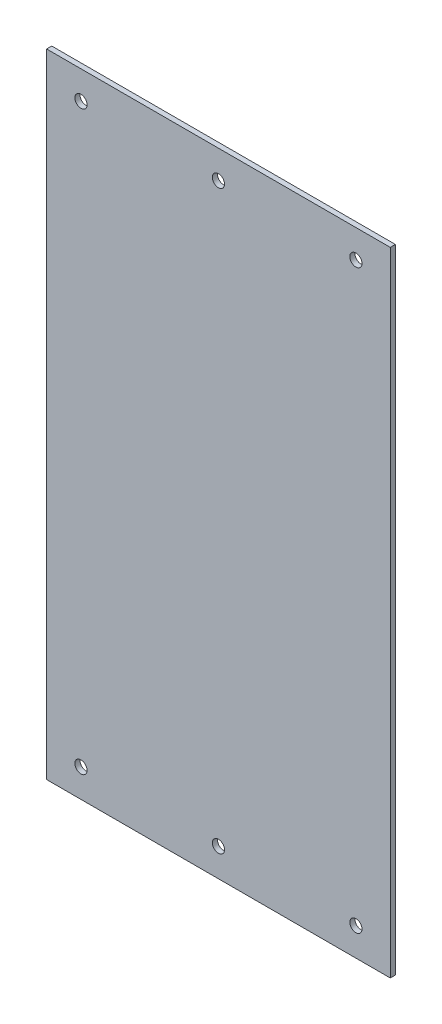
ISO-10303-21;
HEADER;
FILE_DESCRIPTION(('STEP AP214'),'2;1');
FILE_NAME('part.step','',(''),(''),'','','');
FILE_SCHEMA(('AUTOMOTIVE_DESIGN { 1 0 10303 214 1 1 1 1 }'));
ENDSEC;
DATA;
#1=APPLICATION_CONTEXT('core data for automotive mechanical design processes');
#2=APPLICATION_PROTOCOL_DEFINITION('international standard','automotive_design',2000,#1);
#3=PRODUCT_CONTEXT('',#1,'mechanical');
#4=PRODUCT('Part','Part','',(#3));
#5=PRODUCT_RELATED_PRODUCT_CATEGORY('part','',(#4));
#6=PRODUCT_DEFINITION_FORMATION('','',#4);
#7=PRODUCT_DEFINITION_CONTEXT('part definition',#1,'design');
#8=PRODUCT_DEFINITION('design','',#6,#7);
#9=PRODUCT_DEFINITION_SHAPE('','',#8);
#10=(LENGTH_UNIT() NAMED_UNIT(*) SI_UNIT(.MILLI.,.METRE.));
#11=(NAMED_UNIT(*) PLANE_ANGLE_UNIT() SI_UNIT($,.RADIAN.));
#12=(NAMED_UNIT(*) SI_UNIT($,.STERADIAN.) SOLID_ANGLE_UNIT());
#13=UNCERTAINTY_MEASURE_WITH_UNIT(LENGTH_MEASURE(1.E-05),#10,'distance_accuracy_value','');
#14=(GEOMETRIC_REPRESENTATION_CONTEXT(3) GLOBAL_UNCERTAINTY_ASSIGNED_CONTEXT((#13)) GLOBAL_UNIT_ASSIGNED_CONTEXT((#10,
#11,#12)) REPRESENTATION_CONTEXT('',''));
#15=CARTESIAN_POINT('',(0.,0.,0.));
#16=DIRECTION('',(0.,0.,1.));
#17=DIRECTION('',(1.,0.,0.));
#18=AXIS2_PLACEMENT_3D('',#15,#16,#17);
#19=CARTESIAN_POINT('',(77.5,142.695,2.305));
#20=DIRECTION('',(-1.,0.,0.));
#21=DIRECTION('',(0.,-1.,0.));
#22=AXIS2_PLACEMENT_3D('',#19,#20,#21);
#23=PLANE('',#22);
#24=DIRECTION('',(0.,1.,0.));
#25=VECTOR('',#24,1.);
#26=CARTESIAN_POINT('',(77.5,142.695,0.));
#27=LINE('',#26,#25);
#28=CARTESIAN_POINT('',(77.5,-142.695,0.));
#29=VERTEX_POINT('',#28);
#30=CARTESIAN_POINT('',(77.5,142.695,0.));
#31=VERTEX_POINT('',#30);
#32=EDGE_CURVE('E109',#29,#31,#27,.T.);
#33=ORIENTED_EDGE('',*,*,#32,.T.);
#34=DIRECTION('',(0.,0.,-1.));
#35=VECTOR('',#34,1.);
#36=CARTESIAN_POINT('',(77.5,142.695,2.305));
#37=LINE('',#36,#35);
#38=CARTESIAN_POINT('',(77.5,142.695,2.305));
#39=VERTEX_POINT('',#38);
#40=EDGE_CURVE('E11',#39,#31,#37,.T.);
#41=ORIENTED_EDGE('',*,*,#40,.F.);
#42=DIRECTION('',(0.,1.,0.));
#43=VECTOR('',#42,1.);
#44=CARTESIAN_POINT('',(77.5,142.695,2.305));
#45=LINE('',#44,#43);
#46=CARTESIAN_POINT('',(77.5,-142.695,2.305));
#47=VERTEX_POINT('',#46);
#48=EDGE_CURVE('E92',#47,#39,#45,.T.);
#49=ORIENTED_EDGE('',*,*,#48,.F.);
#50=DIRECTION('',(0.,0.,-1.));
#51=VECTOR('',#50,1.);
#52=CARTESIAN_POINT('',(77.5,-142.695,2.305));
#53=LINE('',#52,#51);
#54=EDGE_CURVE('E105',#47,#29,#53,.T.);
#55=ORIENTED_EDGE('',*,*,#54,.T.);
#56=EDGE_LOOP('',(#33,#41,#49,#55));
#57=FACE_BOUND('',#56,.T.);
#58=ADVANCED_FACE('F40',(#57),#23,.F.);
#59=CARTESIAN_POINT('',(-77.5,142.695,2.305));
#60=DIRECTION('',(0.,-1.,0.));
#61=DIRECTION('',(0.,0.,-1.));
#62=AXIS2_PLACEMENT_3D('',#59,#60,#61);
#63=PLANE('',#62);
#64=DIRECTION('',(-1.,0.,0.));
#65=VECTOR('',#64,1.);
#66=CARTESIAN_POINT('',(-77.5,142.695,0.));
#67=LINE('',#66,#65);
#68=CARTESIAN_POINT('',(-77.5,142.695,0.));
#69=VERTEX_POINT('',#68);
#70=EDGE_CURVE('E97',#31,#69,#67,.T.);
#71=ORIENTED_EDGE('',*,*,#70,.T.);
#72=DIRECTION('',(0.,0.,-1.));
#73=VECTOR('',#72,1.);
#74=CARTESIAN_POINT('',(-77.5,142.695,2.305));
#75=LINE('',#74,#73);
#76=CARTESIAN_POINT('',(-77.5,142.695,2.305));
#77=VERTEX_POINT('',#76);
#78=EDGE_CURVE('E49',#77,#69,#75,.T.);
#79=ORIENTED_EDGE('',*,*,#78,.F.);
#80=DIRECTION('',(-1.,0.,0.));
#81=VECTOR('',#80,1.);
#82=CARTESIAN_POINT('',(-77.5,142.695,2.305));
#83=LINE('',#82,#81);
#84=EDGE_CURVE('E87',#39,#77,#83,.T.);
#85=ORIENTED_EDGE('',*,*,#84,.F.);
#86=ORIENTED_EDGE('',*,*,#40,.T.);
#87=EDGE_LOOP('',(#71,#79,#85,#86));
#88=FACE_BOUND('',#87,.T.);
#89=ADVANCED_FACE('F96',(#88),#63,.F.);
#90=CARTESIAN_POINT('',(-77.5,142.695,2.305));
#91=DIRECTION('',(1.,0.,0.));
#92=DIRECTION('',(0.,1.,0.));
#93=AXIS2_PLACEMENT_3D('',#90,#91,#92);
#94=PLANE('',#93);
#95=DIRECTION('',(0.,-1.,0.));
#96=VECTOR('',#95,1.);
#97=CARTESIAN_POINT('',(-77.5,142.695,0.));
#98=LINE('',#97,#96);
#99=CARTESIAN_POINT('',(-77.5,-142.695,0.));
#100=VERTEX_POINT('',#99);
#101=EDGE_CURVE('E74',#69,#100,#98,.T.);
#102=ORIENTED_EDGE('',*,*,#101,.T.);
#103=DIRECTION('',(0.,0.,-1.));
#104=VECTOR('',#103,1.);
#105=CARTESIAN_POINT('',(-77.5,-142.695,2.305));
#106=LINE('',#105,#104);
#107=CARTESIAN_POINT('',(-77.5,-142.695,2.305));
#108=VERTEX_POINT('',#107);
#109=EDGE_CURVE('E99',#108,#100,#106,.T.);
#110=ORIENTED_EDGE('',*,*,#109,.F.);
#111=DIRECTION('',(0.,-1.,0.));
#112=VECTOR('',#111,1.);
#113=CARTESIAN_POINT('',(-77.5,142.695,2.305));
#114=LINE('',#113,#112);
#115=EDGE_CURVE('E90',#77,#108,#114,.T.);
#116=ORIENTED_EDGE('',*,*,#115,.F.);
#117=ORIENTED_EDGE('',*,*,#78,.T.);
#118=EDGE_LOOP('',(#102,#110,#116,#117));
#119=FACE_BOUND('',#118,.T.);
#120=ADVANCED_FACE('F100',(#119),#94,.F.);
#121=CARTESIAN_POINT('',(-77.5,-142.695,2.305));
#122=DIRECTION('',(0.,1.,0.));
#123=DIRECTION('',(0.,0.,1.));
#124=AXIS2_PLACEMENT_3D('',#121,#122,#123);
#125=PLANE('',#124);
#126=DIRECTION('',(1.,0.,0.));
#127=VECTOR('',#126,1.);
#128=CARTESIAN_POINT('',(-77.5,-142.695,0.));
#129=LINE('',#128,#127);
#130=EDGE_CURVE('E80',#100,#29,#129,.T.);
#131=ORIENTED_EDGE('',*,*,#130,.T.);
#132=ORIENTED_EDGE('',*,*,#54,.F.);
#133=DIRECTION('',(1.,0.,0.));
#134=VECTOR('',#133,1.);
#135=CARTESIAN_POINT('',(-77.5,-142.695,2.305));
#136=LINE('',#135,#134);
#137=EDGE_CURVE('E57',#108,#47,#136,.T.);
#138=ORIENTED_EDGE('',*,*,#137,.F.);
#139=ORIENTED_EDGE('',*,*,#109,.T.);
#140=EDGE_LOOP('',(#131,#132,#138,#139));
#141=FACE_BOUND('',#140,.T.);
#142=ADVANCED_FACE('F124',(#141),#125,.F.);
#143=CARTESIAN_POINT('',(0.,0.,2.305));
#144=DIRECTION('',(0.,0.,1.));
#145=DIRECTION('',(1.,0.,0.));
#146=AXIS2_PLACEMENT_3D('',#143,#144,#145);
#147=PLANE('',#146);
#148=CARTESIAN_POINT('',(-62.,129.995,2.305));
#149=DIRECTION('',(0.,0.,1.));
#150=DIRECTION('',(1.,0.,0.));
#151=AXIS2_PLACEMENT_3D('',#148,#149,#150);
#152=CIRCLE('',#151,2.74999999999999);
#153=CARTESIAN_POINT('',(-59.25,129.995,2.305));
#154=VERTEX_POINT('',#153);
#155=EDGE_CURVE('E175',#154,#154,#152,.T.);
#156=ORIENTED_EDGE('',*,*,#155,.F.);
#157=EDGE_LOOP('',(#156));
#158=FACE_BOUND('',#157,.T.);
#159=CARTESIAN_POINT('',(0.,129.995,2.305));
#160=DIRECTION('',(0.,0.,1.));
#161=DIRECTION('',(1.,0.,0.));
#162=AXIS2_PLACEMENT_3D('',#159,#160,#161);
#163=CIRCLE('',#162,2.74999999999999);
#164=CARTESIAN_POINT('',(2.74999999999999,129.995,2.305));
#165=VERTEX_POINT('',#164);
#166=EDGE_CURVE('E167',#165,#165,#163,.T.);
#167=ORIENTED_EDGE('',*,*,#166,.F.);
#168=EDGE_LOOP('',(#167));
#169=FACE_BOUND('',#168,.T.);
#170=CARTESIAN_POINT('',(62.,129.995,2.305));
#171=DIRECTION('',(0.,0.,1.));
#172=DIRECTION('',(1.,0.,0.));
#173=AXIS2_PLACEMENT_3D('',#170,#171,#172);
#174=CIRCLE('',#173,2.74999999999999);
#175=CARTESIAN_POINT('',(64.75,129.995,2.305));
#176=VERTEX_POINT('',#175);
#177=EDGE_CURVE('E159',#176,#176,#174,.T.);
#178=ORIENTED_EDGE('',*,*,#177,.F.);
#179=EDGE_LOOP('',(#178));
#180=FACE_BOUND('',#179,.T.);
#181=CARTESIAN_POINT('',(-62.,-129.995,2.305));
#182=DIRECTION('',(0.,0.,1.));
#183=DIRECTION('',(1.,0.,0.));
#184=AXIS2_PLACEMENT_3D('',#181,#182,#183);
#185=CIRCLE('',#184,2.74999999999999);
#186=CARTESIAN_POINT('',(-59.25,-129.995,2.305));
#187=VERTEX_POINT('',#186);
#188=EDGE_CURVE('E151',#187,#187,#185,.T.);
#189=ORIENTED_EDGE('',*,*,#188,.F.);
#190=EDGE_LOOP('',(#189));
#191=FACE_BOUND('',#190,.T.);
#192=CARTESIAN_POINT('',(0.,-129.995,2.305));
#193=DIRECTION('',(0.,0.,1.));
#194=DIRECTION('',(1.,0.,0.));
#195=AXIS2_PLACEMENT_3D('',#192,#193,#194);
#196=CIRCLE('',#195,2.74999999999999);
#197=CARTESIAN_POINT('',(2.74999999999999,-129.995,2.305));
#198=VERTEX_POINT('',#197);
#199=EDGE_CURVE('E143',#198,#198,#196,.T.);
#200=ORIENTED_EDGE('',*,*,#199,.F.);
#201=EDGE_LOOP('',(#200));
#202=FACE_BOUND('',#201,.T.);
#203=CARTESIAN_POINT('',(62.,-129.995,2.305));
#204=DIRECTION('',(0.,0.,1.));
#205=DIRECTION('',(1.,0.,0.));
#206=AXIS2_PLACEMENT_3D('',#203,#204,#205);
#207=CIRCLE('',#206,2.74999999999999);
#208=CARTESIAN_POINT('',(64.75,-129.995,2.305));
#209=VERTEX_POINT('',#208);
#210=EDGE_CURVE('E135',#209,#209,#207,.T.);
#211=ORIENTED_EDGE('',*,*,#210,.F.);
#212=EDGE_LOOP('',(#211));
#213=FACE_BOUND('',#212,.T.);
#214=ORIENTED_EDGE('',*,*,#48,.T.);
#215=ORIENTED_EDGE('',*,*,#84,.T.);
#216=ORIENTED_EDGE('',*,*,#115,.T.);
#217=ORIENTED_EDGE('',*,*,#137,.T.);
#218=EDGE_LOOP('',(#214,#215,#216,#217));
#219=FACE_BOUND('',#218,.T.);
#220=ADVANCED_FACE('F88',(#158,#169,#180,#191,#202,#213,#219),#147,.T.);
#221=CARTESIAN_POINT('',(0.,0.,0.));
#222=DIRECTION('',(0.,0.,1.));
#223=DIRECTION('',(1.,0.,0.));
#224=AXIS2_PLACEMENT_3D('',#221,#222,#223);
#225=PLANE('',#224);
#226=CARTESIAN_POINT('',(-62.,129.995,0.));
#227=DIRECTION('',(0.,0.,1.));
#228=DIRECTION('',(1.,0.,0.));
#229=AXIS2_PLACEMENT_3D('',#226,#227,#228);
#230=CIRCLE('',#229,2.75);
#231=CARTESIAN_POINT('',(-59.25,129.995,0.));
#232=VERTEX_POINT('',#231);
#233=EDGE_CURVE('E171',#232,#232,#230,.T.);
#234=ORIENTED_EDGE('',*,*,#233,.T.);
#235=EDGE_LOOP('',(#234));
#236=FACE_BOUND('',#235,.T.);
#237=CARTESIAN_POINT('',(0.,129.995,0.));
#238=DIRECTION('',(0.,0.,1.));
#239=DIRECTION('',(1.,0.,0.));
#240=AXIS2_PLACEMENT_3D('',#237,#238,#239);
#241=CIRCLE('',#240,2.75);
#242=CARTESIAN_POINT('',(2.75,129.995,0.));
#243=VERTEX_POINT('',#242);
#244=EDGE_CURVE('E163',#243,#243,#241,.T.);
#245=ORIENTED_EDGE('',*,*,#244,.T.);
#246=EDGE_LOOP('',(#245));
#247=FACE_BOUND('',#246,.T.);
#248=CARTESIAN_POINT('',(62.,129.995,0.));
#249=DIRECTION('',(0.,0.,1.));
#250=DIRECTION('',(1.,0.,0.));
#251=AXIS2_PLACEMENT_3D('',#248,#249,#250);
#252=CIRCLE('',#251,2.75);
#253=CARTESIAN_POINT('',(64.75,129.995,0.));
#254=VERTEX_POINT('',#253);
#255=EDGE_CURVE('E155',#254,#254,#252,.T.);
#256=ORIENTED_EDGE('',*,*,#255,.T.);
#257=EDGE_LOOP('',(#256));
#258=FACE_BOUND('',#257,.T.);
#259=CARTESIAN_POINT('',(-62.,-129.995,0.));
#260=DIRECTION('',(0.,0.,1.));
#261=DIRECTION('',(1.,0.,0.));
#262=AXIS2_PLACEMENT_3D('',#259,#260,#261);
#263=CIRCLE('',#262,2.75);
#264=CARTESIAN_POINT('',(-59.25,-129.995,0.));
#265=VERTEX_POINT('',#264);
#266=EDGE_CURVE('E147',#265,#265,#263,.T.);
#267=ORIENTED_EDGE('',*,*,#266,.T.);
#268=EDGE_LOOP('',(#267));
#269=FACE_BOUND('',#268,.T.);
#270=CARTESIAN_POINT('',(0.,-129.995,0.));
#271=DIRECTION('',(0.,0.,1.));
#272=DIRECTION('',(1.,0.,0.));
#273=AXIS2_PLACEMENT_3D('',#270,#271,#272);
#274=CIRCLE('',#273,2.75);
#275=CARTESIAN_POINT('',(2.75,-129.995,0.));
#276=VERTEX_POINT('',#275);
#277=EDGE_CURVE('E139',#276,#276,#274,.T.);
#278=ORIENTED_EDGE('',*,*,#277,.T.);
#279=EDGE_LOOP('',(#278));
#280=FACE_BOUND('',#279,.T.);
#281=CARTESIAN_POINT('',(62.,-129.995,0.));
#282=DIRECTION('',(0.,0.,1.));
#283=DIRECTION('',(1.,0.,0.));
#284=AXIS2_PLACEMENT_3D('',#281,#282,#283);
#285=CIRCLE('',#284,2.75);
#286=CARTESIAN_POINT('',(64.75,-129.995,0.));
#287=VERTEX_POINT('',#286);
#288=EDGE_CURVE('E113',#287,#287,#285,.T.);
#289=ORIENTED_EDGE('',*,*,#288,.T.);
#290=EDGE_LOOP('',(#289));
#291=FACE_BOUND('',#290,.T.);
#292=ORIENTED_EDGE('',*,*,#32,.F.);
#293=ORIENTED_EDGE('',*,*,#130,.F.);
#294=ORIENTED_EDGE('',*,*,#101,.F.);
#295=ORIENTED_EDGE('',*,*,#70,.F.);
#296=EDGE_LOOP('',(#292,#293,#294,#295));
#297=FACE_BOUND('',#296,.T.);
#298=ADVANCED_FACE('F127',(#236,#247,#258,#269,#280,#291,#297),#225,.F.);
#299=CARTESIAN_POINT('',(62.,-129.995,2.305));
#300=DIRECTION('',(0.,0.,1.));
#301=DIRECTION('',(1.,0.,0.));
#302=AXIS2_PLACEMENT_3D('',#299,#300,#301);
#303=CYLINDRICAL_SURFACE('',#302,2.75);
#304=ORIENTED_EDGE('',*,*,#288,.F.);
#305=EDGE_LOOP('',(#304));
#306=FACE_BOUND('',#305,.T.);
#307=ORIENTED_EDGE('',*,*,#210,.T.);
#308=EDGE_LOOP('',(#307));
#309=FACE_BOUND('',#308,.T.);
#310=ADVANCED_FACE('F196',(#306,#309),#303,.F.);
#311=CARTESIAN_POINT('',(0.,-129.995,2.305));
#312=DIRECTION('',(0.,0.,1.));
#313=DIRECTION('',(1.,0.,0.));
#314=AXIS2_PLACEMENT_3D('',#311,#312,#313);
#315=CYLINDRICAL_SURFACE('',#314,2.74999999999999);
#316=ORIENTED_EDGE('',*,*,#277,.F.);
#317=EDGE_LOOP('',(#316));
#318=FACE_BOUND('',#317,.T.);
#319=ORIENTED_EDGE('',*,*,#199,.T.);
#320=EDGE_LOOP('',(#319));
#321=FACE_BOUND('',#320,.T.);
#322=ADVANCED_FACE('F198',(#318,#321),#315,.F.);
#323=CARTESIAN_POINT('',(-62.,-129.995,2.305));
#324=DIRECTION('',(0.,0.,1.));
#325=DIRECTION('',(1.,0.,0.));
#326=AXIS2_PLACEMENT_3D('',#323,#324,#325);
#327=CYLINDRICAL_SURFACE('',#326,2.74999999999999);
#328=ORIENTED_EDGE('',*,*,#266,.F.);
#329=EDGE_LOOP('',(#328));
#330=FACE_BOUND('',#329,.T.);
#331=ORIENTED_EDGE('',*,*,#188,.T.);
#332=EDGE_LOOP('',(#331));
#333=FACE_BOUND('',#332,.T.);
#334=ADVANCED_FACE('F205',(#330,#333),#327,.F.);
#335=CARTESIAN_POINT('',(62.,129.995,2.305));
#336=DIRECTION('',(0.,0.,1.));
#337=DIRECTION('',(1.,0.,0.));
#338=AXIS2_PLACEMENT_3D('',#335,#336,#337);
#339=CYLINDRICAL_SURFACE('',#338,2.75);
#340=ORIENTED_EDGE('',*,*,#255,.F.);
#341=EDGE_LOOP('',(#340));
#342=FACE_BOUND('',#341,.T.);
#343=ORIENTED_EDGE('',*,*,#177,.T.);
#344=EDGE_LOOP('',(#343));
#345=FACE_BOUND('',#344,.T.);
#346=ADVANCED_FACE('F252',(#342,#345),#339,.F.);
#347=CARTESIAN_POINT('',(0.,129.995,2.305));
#348=DIRECTION('',(0.,0.,1.));
#349=DIRECTION('',(1.,0.,0.));
#350=AXIS2_PLACEMENT_3D('',#347,#348,#349);
#351=CYLINDRICAL_SURFACE('',#350,2.74999999999999);
#352=ORIENTED_EDGE('',*,*,#244,.F.);
#353=EDGE_LOOP('',(#352));
#354=FACE_BOUND('',#353,.T.);
#355=ORIENTED_EDGE('',*,*,#166,.T.);
#356=EDGE_LOOP('',(#355));
#357=FACE_BOUND('',#356,.T.);
#358=ADVANCED_FACE('F262',(#354,#357),#351,.F.);
#359=CARTESIAN_POINT('',(-62.,129.995,2.305));
#360=DIRECTION('',(0.,0.,1.));
#361=DIRECTION('',(1.,0.,0.));
#362=AXIS2_PLACEMENT_3D('',#359,#360,#361);
#363=CYLINDRICAL_SURFACE('',#362,2.74999999999999);
#364=ORIENTED_EDGE('',*,*,#233,.F.);
#365=EDGE_LOOP('',(#364));
#366=FACE_BOUND('',#365,.T.);
#367=ORIENTED_EDGE('',*,*,#155,.T.);
#368=EDGE_LOOP('',(#367));
#369=FACE_BOUND('',#368,.T.);
#370=ADVANCED_FACE('F181',(#366,#369),#363,.F.);
#371=CLOSED_SHELL('',(#58,#89,#120,#142,#220,#298,#310,#322,#334,#346,#358,#370));
#372=MANIFOLD_SOLID_BREP('B2',#371);
#373=ADVANCED_BREP_SHAPE_REPRESENTATION('',(#18,#372),#14);
#374=SHAPE_DEFINITION_REPRESENTATION(#9,#373);
ENDSEC;
END-ISO-10303-21;
